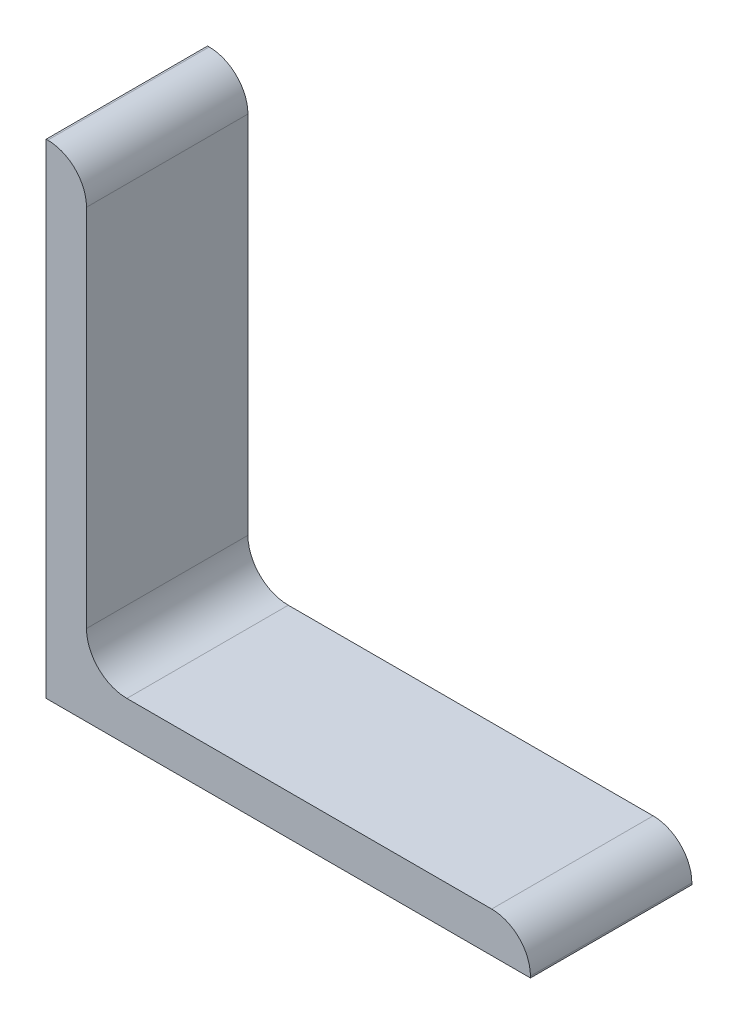
ISO-10303-21;
HEADER;
FILE_DESCRIPTION(('STEP AP214'),'2;1');
FILE_NAME('part.step','',(''),(''),'','','');
FILE_SCHEMA(('AUTOMOTIVE_DESIGN { 1 0 10303 214 1 1 1 1 }'));
ENDSEC;
DATA;
#1=APPLICATION_CONTEXT('core data for automotive mechanical design processes');
#2=APPLICATION_PROTOCOL_DEFINITION('international standard','automotive_design',2000,#1);
#3=PRODUCT_CONTEXT('',#1,'mechanical');
#4=PRODUCT('Part','Part','',(#3));
#5=PRODUCT_RELATED_PRODUCT_CATEGORY('part','',(#4));
#6=PRODUCT_DEFINITION_FORMATION('','',#4);
#7=PRODUCT_DEFINITION_CONTEXT('part definition',#1,'design');
#8=PRODUCT_DEFINITION('design','',#6,#7);
#9=PRODUCT_DEFINITION_SHAPE('','',#8);
#10=(LENGTH_UNIT() NAMED_UNIT(*) SI_UNIT(.MILLI.,.METRE.));
#11=(NAMED_UNIT(*) PLANE_ANGLE_UNIT() SI_UNIT($,.RADIAN.));
#12=(NAMED_UNIT(*) SI_UNIT($,.STERADIAN.) SOLID_ANGLE_UNIT());
#13=UNCERTAINTY_MEASURE_WITH_UNIT(LENGTH_MEASURE(1.E-05),#10,'distance_accuracy_value','');
#14=(GEOMETRIC_REPRESENTATION_CONTEXT(3) GLOBAL_UNCERTAINTY_ASSIGNED_CONTEXT((#13)) GLOBAL_UNIT_ASSIGNED_CONTEXT((#10,
#11,#12)) REPRESENTATION_CONTEXT('',''));
#15=CARTESIAN_POINT('',(0.,0.,0.));
#16=DIRECTION('',(0.,0.,1.));
#17=DIRECTION('',(1.,0.,0.));
#18=AXIS2_PLACEMENT_3D('',#15,#16,#17);
#19=CARTESIAN_POINT('',(53.975,-1.79832258512213,0.));
#20=DIRECTION('',(1.,0.,0.));
#21=DIRECTION('',(0.,0.,-1.));
#22=AXIS2_PLACEMENT_3D('',#19,#20,#21);
#23=PLANE('',#22);
#24=DIRECTION('',(0.,1.,0.));
#25=VECTOR('',#24,1.);
#26=CARTESIAN_POINT('',(53.975,-1.79832258512213,25.4));
#27=LINE('',#26,#25);
#28=CARTESIAN_POINT('',(53.975,-1.79832258512213,25.4));
#29=VERTEX_POINT('',#28);
#30=CARTESIAN_POINT('',(53.975,-2.05232258512213,25.4));
#31=VERTEX_POINT('',#30);
#32=EDGE_CURVE('E150',#29,#31,#27,.F.);
#33=ORIENTED_EDGE('',*,*,#32,.T.);
#34=DIRECTION('',(0.,0.,-1.));
#35=VECTOR('',#34,1.);
#36=CARTESIAN_POINT('',(53.975,-2.05232258512213,0.));
#37=LINE('',#36,#35);
#38=CARTESIAN_POINT('',(53.975,-2.05232258512213,0.));
#39=VERTEX_POINT('',#38);
#40=EDGE_CURVE('E151',#39,#31,#37,.F.);
#41=ORIENTED_EDGE('',*,*,#40,.F.);
#42=DIRECTION('',(0.,1.,0.));
#43=VECTOR('',#42,1.);
#44=CARTESIAN_POINT('',(53.975,19.8362157100276,0.));
#45=LINE('',#44,#43);
#46=CARTESIAN_POINT('',(53.975,-1.79832258512213,0.));
#47=VERTEX_POINT('',#46);
#48=EDGE_CURVE('E84',#39,#47,#45,.T.);
#49=ORIENTED_EDGE('',*,*,#48,.T.);
#50=DIRECTION('',(0.,0.,1.));
#51=VECTOR('',#50,1.);
#52=CARTESIAN_POINT('',(53.975,-1.79832258512213,0.));
#53=LINE('',#52,#51);
#54=EDGE_CURVE('E94',#29,#47,#53,.F.);
#55=ORIENTED_EDGE('',*,*,#54,.F.);
#56=EDGE_LOOP('',(#33,#41,#49,#55));
#57=FACE_BOUND('',#56,.T.);
#58=ADVANCED_FACE('F17',(#57),#23,.T.);
#59=CARTESIAN_POINT('',(47.879,-1.79832258512213,0.));
#60=DIRECTION('',(0.,0.,1.));
#61=DIRECTION('',(1.,0.,0.));
#62=AXIS2_PLACEMENT_3D('',#59,#60,#61);
#63=CYLINDRICAL_SURFACE('',#62,6.096);
#64=CARTESIAN_POINT('',(47.879,-1.79832258512213,25.4));
#65=DIRECTION('',(0.,0.,1.));
#66=DIRECTION('',(1.,0.,0.));
#67=AXIS2_PLACEMENT_3D('',#64,#65,#66);
#68=CIRCLE('',#67,6.096);
#69=CARTESIAN_POINT('',(47.879,4.29767741487787,25.4));
#70=VERTEX_POINT('',#69);
#71=EDGE_CURVE('E168',#29,#70,#68,.T.);
#72=ORIENTED_EDGE('',*,*,#71,.F.);
#73=ORIENTED_EDGE('',*,*,#54,.T.);
#74=CARTESIAN_POINT('',(47.879,-1.79832258512213,0.));
#75=DIRECTION('',(0.,0.,1.));
#76=DIRECTION('',(1.,0.,0.));
#77=AXIS2_PLACEMENT_3D('',#74,#75,#76);
#78=CIRCLE('',#77,6.096);
#79=CARTESIAN_POINT('',(47.879,4.29767741487787,0.));
#80=VERTEX_POINT('',#79);
#81=EDGE_CURVE('E20',#47,#80,#78,.T.);
#82=ORIENTED_EDGE('',*,*,#81,.T.);
#83=DIRECTION('',(0.,0.,1.));
#84=VECTOR('',#83,1.);
#85=CARTESIAN_POINT('',(47.879,4.29767741487787,0.));
#86=LINE('',#85,#84);
#87=EDGE_CURVE('E92',#70,#80,#86,.F.);
#88=ORIENTED_EDGE('',*,*,#87,.F.);
#89=EDGE_LOOP('',(#72,#73,#82,#88));
#90=FACE_BOUND('',#89,.T.);
#91=ADVANCED_FACE('F91',(#90),#63,.T.);
#92=CARTESIAN_POINT('',(-9.52500000000003,4.29767741487787,0.));
#93=DIRECTION('',(0.,1.,0.));
#94=DIRECTION('',(0.,0.,1.));
#95=AXIS2_PLACEMENT_3D('',#92,#93,#94);
#96=PLANE('',#95);
#97=DIRECTION('',(1.,0.,0.));
#98=VECTOR('',#97,1.);
#99=CARTESIAN_POINT('',(-0.336461704850276,4.29767741487786,25.4));
#100=LINE('',#99,#98);
#101=CARTESIAN_POINT('',(-9.52500000000001,4.29767741487788,25.4));
#102=VERTEX_POINT('',#101);
#103=EDGE_CURVE('E102',#70,#102,#100,.F.);
#104=ORIENTED_EDGE('',*,*,#103,.F.);
#105=ORIENTED_EDGE('',*,*,#87,.T.);
#106=DIRECTION('',(1.,0.,0.));
#107=VECTOR('',#106,1.);
#108=CARTESIAN_POINT('',(-0.336461704850276,4.29767741487786,0.));
#109=LINE('',#108,#107);
#110=CARTESIAN_POINT('',(-9.52500000000001,4.29767741487788,0.));
#111=VERTEX_POINT('',#110);
#112=EDGE_CURVE('E97',#80,#111,#109,.F.);
#113=ORIENTED_EDGE('',*,*,#112,.T.);
#114=DIRECTION('',(0.,0.,1.));
#115=VECTOR('',#114,1.);
#116=CARTESIAN_POINT('',(-9.52500000000001,4.2976774148779,0.));
#117=LINE('',#116,#115);
#118=EDGE_CURVE('E104',#111,#102,#117,.T.);
#119=ORIENTED_EDGE('',*,*,#118,.T.);
#120=EDGE_LOOP('',(#104,#105,#113,#119));
#121=FACE_BOUND('',#120,.T.);
#122=ADVANCED_FACE('F99',(#121),#96,.T.);
#123=CARTESIAN_POINT('',(-9.525,10.6476774148779,0.));
#124=DIRECTION('',(0.,0.,1.));
#125=DIRECTION('',(1.,0.,0.));
#126=AXIS2_PLACEMENT_3D('',#123,#124,#125);
#127=CYLINDRICAL_SURFACE('',#126,6.35);
#128=CARTESIAN_POINT('',(-9.525,10.6476774148779,0.));
#129=DIRECTION('',(0.,0.,1.));
#130=DIRECTION('',(1.,0.,0.));
#131=AXIS2_PLACEMENT_3D('',#128,#129,#130);
#132=CIRCLE('',#131,6.35);
#133=CARTESIAN_POINT('',(-15.875,10.6476774148779,0.));
#134=VERTEX_POINT('',#133);
#135=EDGE_CURVE('E109',#111,#134,#132,.F.);
#136=ORIENTED_EDGE('',*,*,#135,.T.);
#137=DIRECTION('',(0.,0.,-1.));
#138=VECTOR('',#137,1.);
#139=CARTESIAN_POINT('',(-15.875,10.6476774148779,0.));
#140=LINE('',#139,#138);
#141=CARTESIAN_POINT('',(-15.875,10.6476774148779,25.4));
#142=VERTEX_POINT('',#141);
#143=EDGE_CURVE('E145',#142,#134,#140,.T.);
#144=ORIENTED_EDGE('',*,*,#143,.F.);
#145=CARTESIAN_POINT('',(-9.525,10.6476774148779,25.4));
#146=DIRECTION('',(0.,0.,1.));
#147=DIRECTION('',(1.,0.,0.));
#148=AXIS2_PLACEMENT_3D('',#145,#146,#147);
#149=CIRCLE('',#148,6.35);
#150=EDGE_CURVE('E173',#102,#142,#149,.F.);
#151=ORIENTED_EDGE('',*,*,#150,.F.);
#152=ORIENTED_EDGE('',*,*,#118,.F.);
#153=EDGE_LOOP('',(#136,#144,#151,#152));
#154=FACE_BOUND('',#153,.T.);
#155=ADVANCED_FACE('F201',(#154),#127,.F.);
#156=CARTESIAN_POINT('',(-15.875,68.0516774148779,0.));
#157=DIRECTION('',(1.,0.,0.));
#158=DIRECTION('',(0.,0.,-1.));
#159=AXIS2_PLACEMENT_3D('',#156,#157,#158);
#160=PLANE('',#159);
#161=DIRECTION('',(0.,1.,0.));
#162=VECTOR('',#161,1.);
#163=CARTESIAN_POINT('',(-15.875,19.8362157100276,25.4));
#164=LINE('',#163,#162);
#165=CARTESIAN_POINT('',(-15.875,68.0516774148779,25.4));
#166=VERTEX_POINT('',#165);
#167=EDGE_CURVE('E172',#142,#166,#164,.T.);
#168=ORIENTED_EDGE('',*,*,#167,.F.);
#169=ORIENTED_EDGE('',*,*,#143,.T.);
#170=DIRECTION('',(0.,1.,0.));
#171=VECTOR('',#170,1.);
#172=CARTESIAN_POINT('',(-15.875,19.8362157100276,0.));
#173=LINE('',#172,#171);
#174=CARTESIAN_POINT('',(-15.875,68.0516774148779,0.));
#175=VERTEX_POINT('',#174);
#176=EDGE_CURVE('E111',#134,#175,#173,.T.);
#177=ORIENTED_EDGE('',*,*,#176,.T.);
#178=DIRECTION('',(0.,0.,1.));
#179=VECTOR('',#178,1.);
#180=CARTESIAN_POINT('',(-15.875,68.0516774148779,0.));
#181=LINE('',#180,#179);
#182=EDGE_CURVE('E116',#166,#175,#181,.F.);
#183=ORIENTED_EDGE('',*,*,#182,.F.);
#184=EDGE_LOOP('',(#168,#169,#177,#183));
#185=FACE_BOUND('',#184,.T.);
#186=ADVANCED_FACE('F183',(#185),#160,.T.);
#187=CARTESIAN_POINT('',(-21.971,68.0516774148779,0.));
#188=DIRECTION('',(0.,0.,1.));
#189=DIRECTION('',(1.,0.,0.));
#190=AXIS2_PLACEMENT_3D('',#187,#188,#189);
#191=CYLINDRICAL_SURFACE('',#190,6.096);
#192=CARTESIAN_POINT('',(-21.971,68.0516774148779,25.4));
#193=DIRECTION('',(0.,0.,1.));
#194=DIRECTION('',(1.,0.,0.));
#195=AXIS2_PLACEMENT_3D('',#192,#193,#194);
#196=CIRCLE('',#195,6.096);
#197=CARTESIAN_POINT('',(-21.971,74.1476774148779,25.4));
#198=VERTEX_POINT('',#197);
#199=EDGE_CURVE('E136',#166,#198,#196,.T.);
#200=ORIENTED_EDGE('',*,*,#199,.F.);
#201=ORIENTED_EDGE('',*,*,#182,.T.);
#202=CARTESIAN_POINT('',(-21.971,68.0516774148779,0.));
#203=DIRECTION('',(0.,0.,1.));
#204=DIRECTION('',(1.,0.,0.));
#205=AXIS2_PLACEMENT_3D('',#202,#203,#204);
#206=CIRCLE('',#205,6.096);
#207=CARTESIAN_POINT('',(-21.971,74.1476774148779,0.));
#208=VERTEX_POINT('',#207);
#209=EDGE_CURVE('E160',#175,#208,#206,.T.);
#210=ORIENTED_EDGE('',*,*,#209,.T.);
#211=DIRECTION('',(0.,0.,1.));
#212=VECTOR('',#211,1.);
#213=CARTESIAN_POINT('',(-21.971,74.1476774148779,0.));
#214=LINE('',#213,#212);
#215=EDGE_CURVE('E119',#198,#208,#214,.F.);
#216=ORIENTED_EDGE('',*,*,#215,.F.);
#217=EDGE_LOOP('',(#200,#201,#210,#216));
#218=FACE_BOUND('',#217,.T.);
#219=ADVANCED_FACE('F185',(#218),#191,.T.);
#220=CARTESIAN_POINT('',(-0.336461704850276,19.8362157100276,0.));
#221=DIRECTION('',(0.,0.,1.));
#222=DIRECTION('',(1.,0.,0.));
#223=AXIS2_PLACEMENT_3D('',#220,#221,#222);
#224=PLANE('',#223);
#225=DIRECTION('',(0.,1.,0.));
#226=VECTOR('',#225,1.);
#227=CARTESIAN_POINT('',(-22.225,-2.05232258512213,0.));
#228=LINE('',#227,#226);
#229=CARTESIAN_POINT('',(-22.225,74.1476774148779,0.));
#230=VERTEX_POINT('',#229);
#231=CARTESIAN_POINT('',(-22.225,-2.05232258512213,0.));
#232=VERTEX_POINT('',#231);
#233=EDGE_CURVE('E122',#230,#232,#228,.F.);
#234=ORIENTED_EDGE('',*,*,#233,.F.);
#235=DIRECTION('',(1.,0.,0.));
#236=VECTOR('',#235,1.);
#237=CARTESIAN_POINT('',(-22.225,74.1476774148779,0.));
#238=LINE('',#237,#236);
#239=EDGE_CURVE('E124',#208,#230,#238,.F.);
#240=ORIENTED_EDGE('',*,*,#239,.F.);
#241=ORIENTED_EDGE('',*,*,#209,.F.);
#242=ORIENTED_EDGE('',*,*,#176,.F.);
#243=ORIENTED_EDGE('',*,*,#135,.F.);
#244=ORIENTED_EDGE('',*,*,#112,.F.);
#245=ORIENTED_EDGE('',*,*,#81,.F.);
#246=ORIENTED_EDGE('',*,*,#48,.F.);
#247=DIRECTION('',(1.,0.,0.));
#248=VECTOR('',#247,1.);
#249=CARTESIAN_POINT('',(53.975,-2.05232258512213,0.));
#250=LINE('',#249,#248);
#251=EDGE_CURVE('E155',#232,#39,#250,.T.);
#252=ORIENTED_EDGE('',*,*,#251,.F.);
#253=EDGE_LOOP('',(#234,#240,#241,#242,#243,#244,#245,#246,#252));
#254=FACE_BOUND('',#253,.T.);
#255=ADVANCED_FACE('F107',(#254),#224,.F.);
#256=CARTESIAN_POINT('',(53.975,-2.05232258512213,0.));
#257=DIRECTION('',(0.,-1.,0.));
#258=DIRECTION('',(0.,0.,-1.));
#259=AXIS2_PLACEMENT_3D('',#256,#257,#258);
#260=PLANE('',#259);
#261=DIRECTION('',(1.,0.,0.));
#262=VECTOR('',#261,1.);
#263=CARTESIAN_POINT('',(-0.336461704850276,-2.05232258512213,25.4));
#264=LINE('',#263,#262);
#265=CARTESIAN_POINT('',(-22.225,-2.05232258512213,25.4));
#266=VERTEX_POINT('',#265);
#267=EDGE_CURVE('E154',#266,#31,#264,.T.);
#268=ORIENTED_EDGE('',*,*,#267,.F.);
#269=DIRECTION('',(0.,0.,1.));
#270=VECTOR('',#269,1.);
#271=CARTESIAN_POINT('',(-22.225,-2.05232258512213,0.));
#272=LINE('',#271,#270);
#273=EDGE_CURVE('E131',#232,#266,#272,.T.);
#274=ORIENTED_EDGE('',*,*,#273,.F.);
#275=ORIENTED_EDGE('',*,*,#251,.T.);
#276=ORIENTED_EDGE('',*,*,#40,.T.);
#277=EDGE_LOOP('',(#268,#274,#275,#276));
#278=FACE_BOUND('',#277,.T.);
#279=ADVANCED_FACE('F196',(#278),#260,.T.);
#280=CARTESIAN_POINT('',(-0.336461704850276,19.8362157100276,25.4));
#281=DIRECTION('',(0.,0.,1.));
#282=DIRECTION('',(1.,0.,0.));
#283=AXIS2_PLACEMENT_3D('',#280,#281,#282);
#284=PLANE('',#283);
#285=ORIENTED_EDGE('',*,*,#167,.T.);
#286=ORIENTED_EDGE('',*,*,#199,.T.);
#287=DIRECTION('',(1.,0.,0.));
#288=VECTOR('',#287,1.);
#289=CARTESIAN_POINT('',(-22.225,74.1476774148779,25.4));
#290=LINE('',#289,#288);
#291=CARTESIAN_POINT('',(-22.225,74.1476774148779,25.4));
#292=VERTEX_POINT('',#291);
#293=EDGE_CURVE('E35',#292,#198,#290,.T.);
#294=ORIENTED_EDGE('',*,*,#293,.F.);
#295=DIRECTION('',(0.,1.,0.));
#296=VECTOR('',#295,1.);
#297=CARTESIAN_POINT('',(-22.225,-2.05232258512213,25.4));
#298=LINE('',#297,#296);
#299=EDGE_CURVE('E26',#266,#292,#298,.T.);
#300=ORIENTED_EDGE('',*,*,#299,.F.);
#301=ORIENTED_EDGE('',*,*,#267,.T.);
#302=ORIENTED_EDGE('',*,*,#32,.F.);
#303=ORIENTED_EDGE('',*,*,#71,.T.);
#304=ORIENTED_EDGE('',*,*,#103,.T.);
#305=ORIENTED_EDGE('',*,*,#150,.T.);
#306=EDGE_LOOP('',(#285,#286,#294,#300,#301,#302,#303,#304,#305));
#307=FACE_BOUND('',#306,.T.);
#308=ADVANCED_FACE('F194',(#307),#284,.T.);
#309=CARTESIAN_POINT('',(-22.225,74.1476774148779,0.));
#310=DIRECTION('',(0.,1.,0.));
#311=DIRECTION('',(0.,0.,1.));
#312=AXIS2_PLACEMENT_3D('',#309,#310,#311);
#313=PLANE('',#312);
#314=ORIENTED_EDGE('',*,*,#293,.T.);
#315=ORIENTED_EDGE('',*,*,#215,.T.);
#316=ORIENTED_EDGE('',*,*,#239,.T.);
#317=DIRECTION('',(0.,0.,1.));
#318=VECTOR('',#317,1.);
#319=CARTESIAN_POINT('',(-22.225,74.1476774148779,0.));
#320=LINE('',#319,#318);
#321=EDGE_CURVE('E11',#292,#230,#320,.F.);
#322=ORIENTED_EDGE('',*,*,#321,.F.);
#323=EDGE_LOOP('',(#314,#315,#316,#322));
#324=FACE_BOUND('',#323,.T.);
#325=ADVANCED_FACE('F189',(#324),#313,.T.);
#326=CARTESIAN_POINT('',(-22.225,-2.05232258512213,0.));
#327=DIRECTION('',(-1.,0.,0.));
#328=DIRECTION('',(0.,0.,1.));
#329=AXIS2_PLACEMENT_3D('',#326,#327,#328);
#330=PLANE('',#329);
#331=ORIENTED_EDGE('',*,*,#299,.T.);
#332=ORIENTED_EDGE('',*,*,#321,.T.);
#333=ORIENTED_EDGE('',*,*,#233,.T.);
#334=ORIENTED_EDGE('',*,*,#273,.T.);
#335=EDGE_LOOP('',(#331,#332,#333,#334));
#336=FACE_BOUND('',#335,.T.);
#337=ADVANCED_FACE('F192',(#336),#330,.T.);
#338=CLOSED_SHELL('',(#58,#91,#122,#155,#186,#219,#255,#279,#308,#325,#337));
#339=MANIFOLD_SOLID_BREP('B1',#338);
#340=ADVANCED_BREP_SHAPE_REPRESENTATION('',(#18,#339),#14);
#341=SHAPE_DEFINITION_REPRESENTATION(#9,#340);
ENDSEC;
END-ISO-10303-21;
